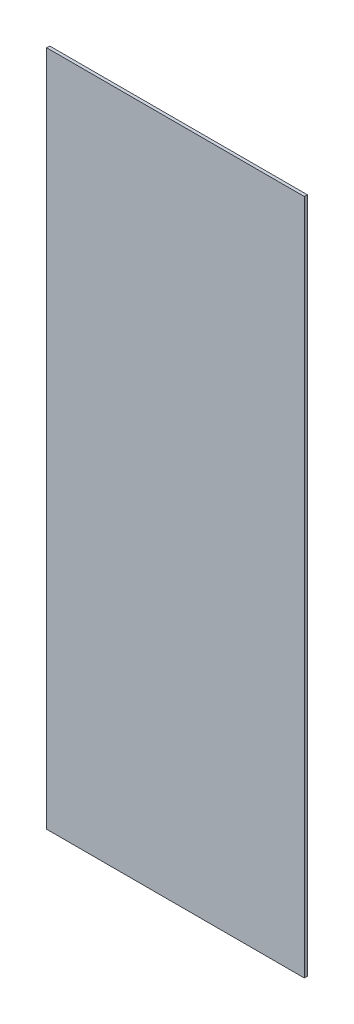
ISO-10303-21;
HEADER;
FILE_DESCRIPTION(('STEP AP214'),'2;1');
FILE_NAME('part.step','',(''),(''),'','','');
FILE_SCHEMA(('AUTOMOTIVE_DESIGN { 1 0 10303 214 1 1 1 1 }'));
ENDSEC;
DATA;
#1=APPLICATION_CONTEXT('core data for automotive mechanical design processes');
#2=APPLICATION_PROTOCOL_DEFINITION('international standard','automotive_design',2000,#1);
#3=PRODUCT_CONTEXT('',#1,'mechanical');
#4=PRODUCT('Part','Part','',(#3));
#5=PRODUCT_RELATED_PRODUCT_CATEGORY('part','',(#4));
#6=PRODUCT_DEFINITION_FORMATION('','',#4);
#7=PRODUCT_DEFINITION_CONTEXT('part definition',#1,'design');
#8=PRODUCT_DEFINITION('design','',#6,#7);
#9=PRODUCT_DEFINITION_SHAPE('','',#8);
#10=(LENGTH_UNIT() NAMED_UNIT(*) SI_UNIT(.MILLI.,.METRE.));
#11=(NAMED_UNIT(*) PLANE_ANGLE_UNIT() SI_UNIT($,.RADIAN.));
#12=(NAMED_UNIT(*) SI_UNIT($,.STERADIAN.) SOLID_ANGLE_UNIT());
#13=UNCERTAINTY_MEASURE_WITH_UNIT(LENGTH_MEASURE(1.E-05),#10,'distance_accuracy_value','');
#14=(GEOMETRIC_REPRESENTATION_CONTEXT(3) GLOBAL_UNCERTAINTY_ASSIGNED_CONTEXT((#13)) GLOBAL_UNIT_ASSIGNED_CONTEXT((#10,
#11,#12)) REPRESENTATION_CONTEXT('',''));
#15=CARTESIAN_POINT('',(0.,0.,0.));
#16=DIRECTION('',(0.,0.,1.));
#17=DIRECTION('',(1.,0.,0.));
#18=AXIS2_PLACEMENT_3D('',#15,#16,#17);
#19=CARTESIAN_POINT('',(418.175,165.85,1.5));
#20=DIRECTION('',(1.,0.,0.));
#21=DIRECTION('',(0.,1.,0.));
#22=AXIS2_PLACEMENT_3D('',#19,#20,#21);
#23=PLANE('',#22);
#24=DIRECTION('',(0.,-1.,0.));
#25=VECTOR('',#24,1.);
#26=CARTESIAN_POINT('',(418.175,165.85,0.));
#27=LINE('',#26,#25);
#28=CARTESIAN_POINT('',(418.175,165.85,0.));
#29=VERTEX_POINT('',#28);
#30=CARTESIAN_POINT('',(418.175,-165.85,0.));
#31=VERTEX_POINT('',#30);
#32=EDGE_CURVE('E95',#29,#31,#27,.T.);
#33=ORIENTED_EDGE('',*,*,#32,.T.);
#34=DIRECTION('',(0.,0.,-1.));
#35=VECTOR('',#34,1.);
#36=CARTESIAN_POINT('',(418.175,-165.85,1.5));
#37=LINE('',#36,#35);
#38=CARTESIAN_POINT('',(418.175,-165.85,1.5));
#39=VERTEX_POINT('',#38);
#40=EDGE_CURVE('E11',#39,#31,#37,.T.);
#41=ORIENTED_EDGE('',*,*,#40,.F.);
#42=DIRECTION('',(0.,-1.,0.));
#43=VECTOR('',#42,1.);
#44=CARTESIAN_POINT('',(418.175,165.85,1.5));
#45=LINE('',#44,#43);
#46=CARTESIAN_POINT('',(418.175,165.85,1.5));
#47=VERTEX_POINT('',#46);
#48=EDGE_CURVE('E83',#47,#39,#45,.T.);
#49=ORIENTED_EDGE('',*,*,#48,.F.);
#50=DIRECTION('',(0.,0.,-1.));
#51=VECTOR('',#50,1.);
#52=CARTESIAN_POINT('',(418.175,165.85,1.5));
#53=LINE('',#52,#51);
#54=EDGE_CURVE('E91',#47,#29,#53,.T.);
#55=ORIENTED_EDGE('',*,*,#54,.T.);
#56=EDGE_LOOP('',(#33,#41,#49,#55));
#57=FACE_BOUND('',#56,.T.);
#58=ADVANCED_FACE('F32',(#57),#23,.F.);
#59=CARTESIAN_POINT('',(418.175,-165.85,1.5));
#60=DIRECTION('',(0.,1.,0.));
#61=DIRECTION('',(0.,0.,1.));
#62=AXIS2_PLACEMENT_3D('',#59,#60,#61);
#63=PLANE('',#62);
#64=DIRECTION('',(1.,0.,0.));
#65=VECTOR('',#64,1.);
#66=CARTESIAN_POINT('',(418.175,-165.85,0.));
#67=LINE('',#66,#65);
#68=CARTESIAN_POINT('',(544.425,-165.85,0.));
#69=VERTEX_POINT('',#68);
#70=EDGE_CURVE('E87',#31,#69,#67,.T.);
#71=ORIENTED_EDGE('',*,*,#70,.T.);
#72=DIRECTION('',(0.,0.,-1.));
#73=VECTOR('',#72,1.);
#74=CARTESIAN_POINT('',(544.425,-165.85,1.5));
#75=LINE('',#74,#73);
#76=CARTESIAN_POINT('',(544.425,-165.85,1.5));
#77=VERTEX_POINT('',#76);
#78=EDGE_CURVE('E40',#77,#69,#75,.T.);
#79=ORIENTED_EDGE('',*,*,#78,.F.);
#80=DIRECTION('',(1.,0.,0.));
#81=VECTOR('',#80,1.);
#82=CARTESIAN_POINT('',(418.175,-165.85,1.5));
#83=LINE('',#82,#81);
#84=EDGE_CURVE('E78',#39,#77,#83,.T.);
#85=ORIENTED_EDGE('',*,*,#84,.F.);
#86=ORIENTED_EDGE('',*,*,#40,.T.);
#87=EDGE_LOOP('',(#71,#79,#85,#86));
#88=FACE_BOUND('',#87,.T.);
#89=ADVANCED_FACE('F86',(#88),#63,.F.);
#90=CARTESIAN_POINT('',(544.425,165.85,1.5));
#91=DIRECTION('',(-1.,0.,0.));
#92=DIRECTION('',(0.,0.,1.));
#93=AXIS2_PLACEMENT_3D('',#90,#91,#92);
#94=PLANE('',#93);
#95=DIRECTION('',(0.,1.,0.));
#96=VECTOR('',#95,1.);
#97=CARTESIAN_POINT('',(544.425,165.85,0.));
#98=LINE('',#97,#96);
#99=CARTESIAN_POINT('',(544.425,165.85,0.));
#100=VERTEX_POINT('',#99);
#101=EDGE_CURVE('E65',#69,#100,#98,.T.);
#102=ORIENTED_EDGE('',*,*,#101,.T.);
#103=DIRECTION('',(0.,0.,-1.));
#104=VECTOR('',#103,1.);
#105=CARTESIAN_POINT('',(544.425,165.85,1.5));
#106=LINE('',#105,#104);
#107=CARTESIAN_POINT('',(544.425,165.85,1.5));
#108=VERTEX_POINT('',#107);
#109=EDGE_CURVE('E88',#108,#100,#106,.T.);
#110=ORIENTED_EDGE('',*,*,#109,.F.);
#111=DIRECTION('',(0.,1.,0.));
#112=VECTOR('',#111,1.);
#113=CARTESIAN_POINT('',(544.425,165.85,1.5));
#114=LINE('',#113,#112);
#115=EDGE_CURVE('E81',#77,#108,#114,.T.);
#116=ORIENTED_EDGE('',*,*,#115,.F.);
#117=ORIENTED_EDGE('',*,*,#78,.T.);
#118=EDGE_LOOP('',(#102,#110,#116,#117));
#119=FACE_BOUND('',#118,.T.);
#120=ADVANCED_FACE('F89',(#119),#94,.F.);
#121=CARTESIAN_POINT('',(418.175,165.85,1.5));
#122=DIRECTION('',(0.,-1.,0.));
#123=DIRECTION('',(0.,0.,-1.));
#124=AXIS2_PLACEMENT_3D('',#121,#122,#123);
#125=PLANE('',#124);
#126=DIRECTION('',(-1.,0.,0.));
#127=VECTOR('',#126,1.);
#128=CARTESIAN_POINT('',(418.175,165.85,0.));
#129=LINE('',#128,#127);
#130=EDGE_CURVE('E71',#100,#29,#129,.T.);
#131=ORIENTED_EDGE('',*,*,#130,.T.);
#132=ORIENTED_EDGE('',*,*,#54,.F.);
#133=DIRECTION('',(-1.,0.,0.));
#134=VECTOR('',#133,1.);
#135=CARTESIAN_POINT('',(418.175,165.85,1.5));
#136=LINE('',#135,#134);
#137=EDGE_CURVE('E48',#108,#47,#136,.T.);
#138=ORIENTED_EDGE('',*,*,#137,.F.);
#139=ORIENTED_EDGE('',*,*,#109,.T.);
#140=EDGE_LOOP('',(#131,#132,#138,#139));
#141=FACE_BOUND('',#140,.T.);
#142=ADVANCED_FACE('F102',(#141),#125,.F.);
#143=CARTESIAN_POINT('',(418.175,-165.85,1.5));
#144=DIRECTION('',(0.,0.,1.));
#145=DIRECTION('',(1.,0.,0.));
#146=AXIS2_PLACEMENT_3D('',#143,#144,#145);
#147=PLANE('',#146);
#148=ORIENTED_EDGE('',*,*,#48,.T.);
#149=ORIENTED_EDGE('',*,*,#84,.T.);
#150=ORIENTED_EDGE('',*,*,#115,.T.);
#151=ORIENTED_EDGE('',*,*,#137,.T.);
#152=EDGE_LOOP('',(#148,#149,#150,#151));
#153=FACE_BOUND('',#152,.T.);
#154=ADVANCED_FACE('F79',(#153),#147,.T.);
#155=CARTESIAN_POINT('',(418.175,-165.85,0.));
#156=DIRECTION('',(0.,0.,1.));
#157=DIRECTION('',(1.,0.,0.));
#158=AXIS2_PLACEMENT_3D('',#155,#156,#157);
#159=PLANE('',#158);
#160=ORIENTED_EDGE('',*,*,#32,.F.);
#161=ORIENTED_EDGE('',*,*,#130,.F.);
#162=ORIENTED_EDGE('',*,*,#101,.F.);
#163=ORIENTED_EDGE('',*,*,#70,.F.);
#164=EDGE_LOOP('',(#160,#161,#162,#163));
#165=FACE_BOUND('',#164,.T.);
#166=ADVANCED_FACE('F105',(#165),#159,.F.);
#167=CLOSED_SHELL('',(#58,#89,#120,#142,#154,#166));
#168=MANIFOLD_SOLID_BREP('B2',#167);
#169=ADVANCED_BREP_SHAPE_REPRESENTATION('',(#18,#168),#14);
#170=SHAPE_DEFINITION_REPRESENTATION(#9,#169);
ENDSEC;
END-ISO-10303-21;
